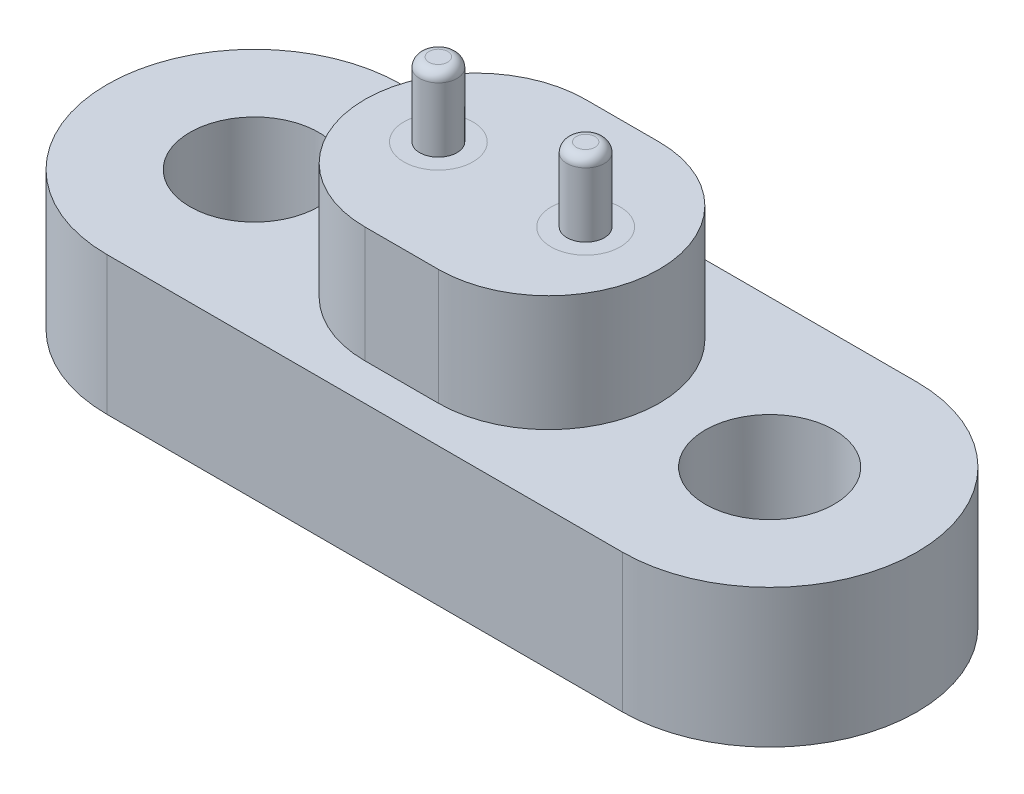
ISO-10303-21;
HEADER;
FILE_DESCRIPTION(('STEP AP214'),'2;1');
FILE_NAME('part.step','',(''),(''),'','','');
FILE_SCHEMA(('AUTOMOTIVE_DESIGN { 1 0 10303 214 1 1 1 1 }'));
ENDSEC;
DATA;
#1=APPLICATION_CONTEXT('core data for automotive mechanical design processes');
#2=APPLICATION_PROTOCOL_DEFINITION('international standard','automotive_design',2000,#1);
#3=PRODUCT_CONTEXT('',#1,'mechanical');
#4=PRODUCT('Part','Part','',(#3));
#5=PRODUCT_RELATED_PRODUCT_CATEGORY('part','',(#4));
#6=PRODUCT_DEFINITION_FORMATION('','',#4);
#7=PRODUCT_DEFINITION_CONTEXT('part definition',#1,'design');
#8=PRODUCT_DEFINITION('design','',#6,#7);
#9=PRODUCT_DEFINITION_SHAPE('','',#8);
#10=(LENGTH_UNIT() NAMED_UNIT(*) SI_UNIT(.MILLI.,.METRE.));
#11=(NAMED_UNIT(*) PLANE_ANGLE_UNIT() SI_UNIT($,.RADIAN.));
#12=(NAMED_UNIT(*) SI_UNIT($,.STERADIAN.) SOLID_ANGLE_UNIT());
#13=UNCERTAINTY_MEASURE_WITH_UNIT(LENGTH_MEASURE(1.E-05),#10,'distance_accuracy_value','');
#14=(GEOMETRIC_REPRESENTATION_CONTEXT(3) GLOBAL_UNCERTAINTY_ASSIGNED_CONTEXT((#13)) GLOBAL_UNIT_ASSIGNED_CONTEXT((#10,
#11,#12)) REPRESENTATION_CONTEXT('',''));
#15=CARTESIAN_POINT('',(0.,0.,0.));
#16=DIRECTION('',(0.,0.,1.));
#17=DIRECTION('',(1.,0.,0.));
#18=AXIS2_PLACEMENT_3D('',#15,#16,#17);
#19=CARTESIAN_POINT('',(2.00025,8.9088,0.));
#20=DIRECTION('',(0.,-1.,0.));
#21=DIRECTION('',(0.,0.,-1.));
#22=AXIS2_PLACEMENT_3D('',#19,#20,#21);
#23=CYLINDRICAL_SURFACE('',#22,0.508);
#24=CARTESIAN_POINT('',(2.00025,8.6548,0.));
#25=DIRECTION('',(0.,-1.,0.));
#26=DIRECTION('',(0.,0.,-1.));
#27=AXIS2_PLACEMENT_3D('',#24,#25,#26);
#28=CIRCLE('',#27,0.508);
#29=CARTESIAN_POINT('',(2.00025,8.6548,-0.508000000000001));
#30=VERTEX_POINT('',#29);
#31=EDGE_CURVE('E47',#30,#30,#28,.T.);
#32=ORIENTED_EDGE('',*,*,#31,.T.);
#33=EDGE_LOOP('',(#32));
#34=FACE_BOUND('',#33,.T.);
#35=CARTESIAN_POINT('',(2.00025,6.9088,0.));
#36=DIRECTION('',(0.,-1.,0.));
#37=DIRECTION('',(0.,0.,-1.));
#38=AXIS2_PLACEMENT_3D('',#35,#36,#37);
#39=CIRCLE('',#38,0.508);
#40=CARTESIAN_POINT('',(2.00025,6.9088,-0.508000000000001));
#41=VERTEX_POINT('',#40);
#42=EDGE_CURVE('E51',#41,#41,#39,.T.);
#43=ORIENTED_EDGE('',*,*,#42,.F.);
#44=EDGE_LOOP('',(#43));
#45=FACE_BOUND('',#44,.T.);
#46=ADVANCED_FACE('F40',(#34,#45),#23,.T.);
#47=CARTESIAN_POINT('',(2.00025,8.9088,0.));
#48=DIRECTION('',(0.,-1.,0.));
#49=DIRECTION('',(0.,0.,-1.));
#50=AXIS2_PLACEMENT_3D('',#47,#48,#49);
#51=PLANE('',#50);
#52=CARTESIAN_POINT('',(2.00025,8.9088,0.));
#53=DIRECTION('',(0.,-1.,0.));
#54=DIRECTION('',(0.,0.,-1.));
#55=AXIS2_PLACEMENT_3D('',#52,#53,#54);
#56=CIRCLE('',#55,0.254);
#57=CARTESIAN_POINT('',(2.00025,8.9088,-0.254000000000001));
#58=VERTEX_POINT('',#57);
#59=EDGE_CURVE('E11',#58,#58,#56,.F.);
#60=ORIENTED_EDGE('',*,*,#59,.T.);
#61=EDGE_LOOP('',(#60));
#62=FACE_BOUND('',#61,.T.);
#63=ADVANCED_FACE('F61',(#62),#51,.F.);
#64=CARTESIAN_POINT('',(2.00025,6.9088,0.));
#65=DIRECTION('',(0.,-1.,0.));
#66=DIRECTION('',(0.,0.,-1.));
#67=AXIS2_PLACEMENT_3D('',#64,#65,#66);
#68=PLANE('',#67);
#69=ORIENTED_EDGE('',*,*,#42,.T.);
#70=EDGE_LOOP('',(#69));
#71=FACE_BOUND('',#70,.T.);
#72=ADVANCED_FACE('F58',(#71),#68,.T.);
#73=CARTESIAN_POINT('',(2.00025,8.6548,0.));
#74=DIRECTION('',(0.,-1.,0.));
#75=DIRECTION('',(0.,0.,-1.));
#76=AXIS2_PLACEMENT_3D('',#73,#74,#75);
#77=TOROIDAL_SURFACE('',#76,0.254,0.254);
#78=ORIENTED_EDGE('',*,*,#59,.F.);
#79=EDGE_LOOP('',(#78));
#80=FACE_BOUND('',#79,.T.);
#81=ORIENTED_EDGE('',*,*,#31,.F.);
#82=EDGE_LOOP('',(#81));
#83=FACE_BOUND('',#82,.T.);
#84=ADVANCED_FACE('F42',(#80,#83),#77,.T.);
#85=CLOSED_SHELL('',(#46,#63,#72,#84));
#86=MANIFOLD_SOLID_BREP('B2',#85);
#87=CARTESIAN_POINT('',(-2.00025,8.9088,0.));
#88=DIRECTION('',(0.,-1.,0.));
#89=DIRECTION('',(0.,0.,-1.));
#90=AXIS2_PLACEMENT_3D('',#87,#88,#89);
#91=CYLINDRICAL_SURFACE('',#90,0.508);
#92=CARTESIAN_POINT('',(-2.00025,8.6548,0.));
#93=DIRECTION('',(0.,-1.,0.));
#94=DIRECTION('',(0.,0.,-1.));
#95=AXIS2_PLACEMENT_3D('',#92,#93,#94);
#96=CIRCLE('',#95,0.508);
#97=CARTESIAN_POINT('',(-2.00025,8.6548,-0.508));
#98=VERTEX_POINT('',#97);
#99=EDGE_CURVE('E111',#98,#98,#96,.T.);
#100=ORIENTED_EDGE('',*,*,#99,.T.);
#101=EDGE_LOOP('',(#100));
#102=FACE_BOUND('',#101,.T.);
#103=CARTESIAN_POINT('',(-2.00025,6.9088,0.));
#104=DIRECTION('',(0.,-1.,0.));
#105=DIRECTION('',(0.,0.,-1.));
#106=AXIS2_PLACEMENT_3D('',#103,#104,#105);
#107=CIRCLE('',#106,0.508);
#108=CARTESIAN_POINT('',(-2.00025,6.9088,-0.508));
#109=VERTEX_POINT('',#108);
#110=EDGE_CURVE('E115',#109,#109,#107,.T.);
#111=ORIENTED_EDGE('',*,*,#110,.F.);
#112=EDGE_LOOP('',(#111));
#113=FACE_BOUND('',#112,.T.);
#114=ADVANCED_FACE('F104',(#102,#113),#91,.T.);
#115=CARTESIAN_POINT('',(-2.00025,8.9088,0.));
#116=DIRECTION('',(0.,-1.,0.));
#117=DIRECTION('',(0.,0.,-1.));
#118=AXIS2_PLACEMENT_3D('',#115,#116,#117);
#119=PLANE('',#118);
#120=CARTESIAN_POINT('',(-2.00025,8.9088,0.));
#121=DIRECTION('',(0.,-1.,0.));
#122=DIRECTION('',(0.,0.,-1.));
#123=AXIS2_PLACEMENT_3D('',#120,#121,#122);
#124=CIRCLE('',#123,0.254);
#125=CARTESIAN_POINT('',(-2.00025,8.9088,-0.254));
#126=VERTEX_POINT('',#125);
#127=EDGE_CURVE('E39',#126,#126,#124,.F.);
#128=ORIENTED_EDGE('',*,*,#127,.T.);
#129=EDGE_LOOP('',(#128));
#130=FACE_BOUND('',#129,.T.);
#131=ADVANCED_FACE('F125',(#130),#119,.F.);
#132=CARTESIAN_POINT('',(-2.00025,6.9088,0.));
#133=DIRECTION('',(0.,-1.,0.));
#134=DIRECTION('',(0.,0.,-1.));
#135=AXIS2_PLACEMENT_3D('',#132,#133,#134);
#136=PLANE('',#135);
#137=ORIENTED_EDGE('',*,*,#110,.T.);
#138=EDGE_LOOP('',(#137));
#139=FACE_BOUND('',#138,.T.);
#140=ADVANCED_FACE('F122',(#139),#136,.T.);
#141=CARTESIAN_POINT('',(-2.00025,8.6548,0.));
#142=DIRECTION('',(0.,-1.,0.));
#143=DIRECTION('',(0.,0.,-1.));
#144=AXIS2_PLACEMENT_3D('',#141,#142,#143);
#145=DEGENERATE_TOROIDAL_SURFACE('',#144,0.254,0.254,.T.);
#146=ORIENTED_EDGE('',*,*,#127,.F.);
#147=EDGE_LOOP('',(#146));
#148=FACE_BOUND('',#147,.T.);
#149=ORIENTED_EDGE('',*,*,#99,.F.);
#150=EDGE_LOOP('',(#149));
#151=FACE_BOUND('',#150,.T.);
#152=ADVANCED_FACE('F106',(#148,#151),#145,.T.);
#153=CLOSED_SHELL('',(#114,#131,#140,#152));
#154=MANIFOLD_SOLID_BREP('B6',#153);
#155=CARTESIAN_POINT('',(2.00025,-0.0762000000000011,0.));
#156=DIRECTION('',(0.,1.,0.));
#157=DIRECTION('',(0.,0.,1.));
#158=AXIS2_PLACEMENT_3D('',#155,#156,#157);
#159=CYLINDRICAL_SURFACE('',#158,0.9398);
#160=CARTESIAN_POINT('',(2.00025,-0.0762000000000011,0.));
#161=DIRECTION('',(0.,1.,0.));
#162=DIRECTION('',(0.,0.,1.));
#163=AXIS2_PLACEMENT_3D('',#160,#161,#162);
#164=CIRCLE('',#163,0.9398);
#165=CARTESIAN_POINT('',(2.00025,-0.0762000000000011,0.939799999999999));
#166=VERTEX_POINT('',#165);
#167=EDGE_CURVE('E103',#166,#166,#164,.T.);
#168=ORIENTED_EDGE('',*,*,#167,.T.);
#169=EDGE_LOOP('',(#168));
#170=FACE_BOUND('',#169,.T.);
#171=CARTESIAN_POINT('',(2.00025,6.9088,0.));
#172=DIRECTION('',(0.,1.,0.));
#173=DIRECTION('',(0.,0.,1.));
#174=AXIS2_PLACEMENT_3D('',#171,#172,#173);
#175=CIRCLE('',#174,0.9398);
#176=CARTESIAN_POINT('',(2.00025,6.9088,0.939799999999999));
#177=VERTEX_POINT('',#176);
#178=EDGE_CURVE('E171',#177,#177,#175,.T.);
#179=ORIENTED_EDGE('',*,*,#178,.F.);
#180=EDGE_LOOP('',(#179));
#181=FACE_BOUND('',#180,.T.);
#182=ADVANCED_FACE('F168',(#170,#181),#159,.T.);
#183=CARTESIAN_POINT('',(2.00025,-0.0762000000000011,0.));
#184=DIRECTION('',(0.,1.,0.));
#185=DIRECTION('',(0.,0.,1.));
#186=AXIS2_PLACEMENT_3D('',#183,#184,#185);
#187=PLANE('',#186);
#188=ORIENTED_EDGE('',*,*,#167,.F.);
#189=EDGE_LOOP('',(#188));
#190=FACE_BOUND('',#189,.T.);
#191=ADVANCED_FACE('F183',(#190),#187,.F.);
#192=CARTESIAN_POINT('',(2.00025,6.9088,0.));
#193=DIRECTION('',(0.,1.,0.));
#194=DIRECTION('',(0.,0.,1.));
#195=AXIS2_PLACEMENT_3D('',#192,#193,#194);
#196=PLANE('',#195);
#197=ORIENTED_EDGE('',*,*,#178,.T.);
#198=EDGE_LOOP('',(#197));
#199=FACE_BOUND('',#198,.T.);
#200=ADVANCED_FACE('F180',(#199),#196,.T.);
#201=CLOSED_SHELL('',(#182,#191,#200));
#202=MANIFOLD_SOLID_BREP('B34',#201);
#203=CARTESIAN_POINT('',(-2.00025,-0.0762000000000011,0.));
#204=DIRECTION('',(0.,1.,0.));
#205=DIRECTION('',(0.,0.,1.));
#206=AXIS2_PLACEMENT_3D('',#203,#204,#205);
#207=CYLINDRICAL_SURFACE('',#206,0.9398);
#208=CARTESIAN_POINT('',(-2.00025,-0.0762000000000011,0.));
#209=DIRECTION('',(0.,1.,0.));
#210=DIRECTION('',(0.,0.,1.));
#211=AXIS2_PLACEMENT_3D('',#208,#209,#210);
#212=CIRCLE('',#211,0.9398);
#213=CARTESIAN_POINT('',(-2.00025,-0.0762000000000011,0.9398));
#214=VERTEX_POINT('',#213);
#215=EDGE_CURVE('E167',#214,#214,#212,.T.);
#216=ORIENTED_EDGE('',*,*,#215,.T.);
#217=EDGE_LOOP('',(#216));
#218=FACE_BOUND('',#217,.T.);
#219=CARTESIAN_POINT('',(-2.00025,6.9088,0.));
#220=DIRECTION('',(0.,1.,0.));
#221=DIRECTION('',(0.,0.,1.));
#222=AXIS2_PLACEMENT_3D('',#219,#220,#221);
#223=CIRCLE('',#222,0.9398);
#224=CARTESIAN_POINT('',(-2.00025,6.9088,0.9398));
#225=VERTEX_POINT('',#224);
#226=EDGE_CURVE('E221',#225,#225,#223,.T.);
#227=ORIENTED_EDGE('',*,*,#226,.F.);
#228=EDGE_LOOP('',(#227));
#229=FACE_BOUND('',#228,.T.);
#230=ADVANCED_FACE('F218',(#218,#229),#207,.T.);
#231=CARTESIAN_POINT('',(-2.00025,-0.0762000000000011,0.));
#232=DIRECTION('',(0.,1.,0.));
#233=DIRECTION('',(0.,0.,1.));
#234=AXIS2_PLACEMENT_3D('',#231,#232,#233);
#235=PLANE('',#234);
#236=ORIENTED_EDGE('',*,*,#215,.F.);
#237=EDGE_LOOP('',(#236));
#238=FACE_BOUND('',#237,.T.);
#239=ADVANCED_FACE('F233',(#238),#235,.F.);
#240=CARTESIAN_POINT('',(-2.00025,6.9088,0.));
#241=DIRECTION('',(0.,1.,0.));
#242=DIRECTION('',(0.,0.,1.));
#243=AXIS2_PLACEMENT_3D('',#240,#241,#242);
#244=PLANE('',#243);
#245=ORIENTED_EDGE('',*,*,#226,.T.);
#246=EDGE_LOOP('',(#245));
#247=FACE_BOUND('',#246,.T.);
#248=ADVANCED_FACE('F230',(#247),#244,.T.);
#249=CLOSED_SHELL('',(#230,#239,#248));
#250=MANIFOLD_SOLID_BREP('B98',#249);
#251=CARTESIAN_POINT('',(-6.99897,3.7592,0.));
#252=DIRECTION('',(0.,-1.,0.));
#253=DIRECTION('',(0.,0.,-1.));
#254=AXIS2_PLACEMENT_3D('',#251,#252,#253);
#255=CYLINDRICAL_SURFACE('',#254,4.0005);
#256=CARTESIAN_POINT('',(-6.99897,0.,0.));
#257=DIRECTION('',(0.,1.,0.));
#258=DIRECTION('',(0.,0.,1.));
#259=AXIS2_PLACEMENT_3D('',#256,#257,#258);
#260=CIRCLE('',#259,4.0005);
#261=CARTESIAN_POINT('',(-6.99897,0.,-4.0005));
#262=VERTEX_POINT('',#261);
#263=CARTESIAN_POINT('',(-6.99897,0.,4.0005));
#264=VERTEX_POINT('',#263);
#265=EDGE_CURVE('E346',#262,#264,#260,.T.);
#266=ORIENTED_EDGE('',*,*,#265,.T.);
#267=DIRECTION('',(0.,-1.,0.));
#268=VECTOR('',#267,1.);
#269=CARTESIAN_POINT('',(-6.99897,3.7592,4.0005));
#270=LINE('',#269,#268);
#271=CARTESIAN_POINT('',(-6.99897,3.7592,4.0005));
#272=VERTEX_POINT('',#271);
#273=EDGE_CURVE('E216',#272,#264,#270,.T.);
#274=ORIENTED_EDGE('',*,*,#273,.F.);
#275=CARTESIAN_POINT('',(-6.99897,3.7592,0.));
#276=DIRECTION('',(0.,1.,0.));
#277=DIRECTION('',(0.,0.,1.));
#278=AXIS2_PLACEMENT_3D('',#275,#276,#277);
#279=CIRCLE('',#278,4.0005);
#280=CARTESIAN_POINT('',(-6.99897,3.7592,-4.0005));
#281=VERTEX_POINT('',#280);
#282=EDGE_CURVE('E355',#281,#272,#279,.T.);
#283=ORIENTED_EDGE('',*,*,#282,.F.);
#284=DIRECTION('',(0.,-1.,0.));
#285=VECTOR('',#284,1.);
#286=CARTESIAN_POINT('',(-6.99897,3.7592,-4.0005));
#287=LINE('',#286,#285);
#288=EDGE_CURVE('E364',#281,#262,#287,.T.);
#289=ORIENTED_EDGE('',*,*,#288,.T.);
#290=EDGE_LOOP('',(#266,#274,#283,#289));
#291=FACE_BOUND('',#290,.T.);
#292=ADVANCED_FACE('F259',(#291),#255,.T.);
#293=CARTESIAN_POINT('',(-6.99897,3.7592,4.0005));
#294=DIRECTION('',(0.,0.,-1.));
#295=DIRECTION('',(-1.,0.,0.));
#296=AXIS2_PLACEMENT_3D('',#293,#294,#295);
#297=PLANE('',#296);
#298=DIRECTION('',(1.,0.,0.));
#299=VECTOR('',#298,1.);
#300=CARTESIAN_POINT('',(-6.99897,0.,4.0005));
#301=LINE('',#300,#299);
#302=CARTESIAN_POINT('',(6.99897,0.,4.0005));
#303=VERTEX_POINT('',#302);
#304=EDGE_CURVE('E349',#264,#303,#301,.T.);
#305=ORIENTED_EDGE('',*,*,#304,.T.);
#306=DIRECTION('',(0.,-1.,0.));
#307=VECTOR('',#306,1.);
#308=CARTESIAN_POINT('',(6.99897,3.7592,4.0005));
#309=LINE('',#308,#307);
#310=CARTESIAN_POINT('',(6.99897,3.7592,4.0005));
#311=VERTEX_POINT('',#310);
#312=EDGE_CURVE('E267',#311,#303,#309,.T.);
#313=ORIENTED_EDGE('',*,*,#312,.F.);
#314=DIRECTION('',(1.,0.,0.));
#315=VECTOR('',#314,1.);
#316=CARTESIAN_POINT('',(-6.99897,3.7592,4.0005));
#317=LINE('',#316,#315);
#318=EDGE_CURVE('E358',#272,#311,#317,.T.);
#319=ORIENTED_EDGE('',*,*,#318,.F.);
#320=ORIENTED_EDGE('',*,*,#273,.T.);
#321=EDGE_LOOP('',(#305,#313,#319,#320));
#322=FACE_BOUND('',#321,.T.);
#323=ADVANCED_FACE('F434',(#322),#297,.F.);
#324=CARTESIAN_POINT('',(6.99897,3.7592,0.));
#325=DIRECTION('',(0.,-1.,0.));
#326=DIRECTION('',(0.,0.,-1.));
#327=AXIS2_PLACEMENT_3D('',#324,#325,#326);
#328=CYLINDRICAL_SURFACE('',#327,4.0005);
#329=CARTESIAN_POINT('',(6.99897,0.,0.));
#330=DIRECTION('',(0.,1.,0.));
#331=DIRECTION('',(0.,0.,1.));
#332=AXIS2_PLACEMENT_3D('',#329,#330,#331);
#333=CIRCLE('',#332,4.0005);
#334=CARTESIAN_POINT('',(6.99897,0.,-4.00050000000001));
#335=VERTEX_POINT('',#334);
#336=EDGE_CURVE('E367',#303,#335,#333,.T.);
#337=ORIENTED_EDGE('',*,*,#336,.T.);
#338=DIRECTION('',(0.,-1.,0.));
#339=VECTOR('',#338,1.);
#340=CARTESIAN_POINT('',(6.99897,3.7592,-4.00050000000001));
#341=LINE('',#340,#339);
#342=CARTESIAN_POINT('',(6.99897,3.7592,-4.00050000000001));
#343=VERTEX_POINT('',#342);
#344=EDGE_CURVE('E372',#343,#335,#341,.T.);
#345=ORIENTED_EDGE('',*,*,#344,.F.);
#346=CARTESIAN_POINT('',(6.99897,3.7592,0.));
#347=DIRECTION('',(0.,1.,0.));
#348=DIRECTION('',(0.,0.,1.));
#349=AXIS2_PLACEMENT_3D('',#346,#347,#348);
#350=CIRCLE('',#349,4.0005);
#351=EDGE_CURVE('E361',#311,#343,#350,.T.);
#352=ORIENTED_EDGE('',*,*,#351,.F.);
#353=ORIENTED_EDGE('',*,*,#312,.T.);
#354=EDGE_LOOP('',(#337,#345,#352,#353));
#355=FACE_BOUND('',#354,.T.);
#356=ADVANCED_FACE('F439',(#355),#328,.T.);
#357=CARTESIAN_POINT('',(-6.99897,3.7592,-4.0005));
#358=DIRECTION('',(0.,0.,1.));
#359=DIRECTION('',(1.,0.,0.));
#360=AXIS2_PLACEMENT_3D('',#357,#358,#359);
#361=PLANE('',#360);
#362=DIRECTION('',(-1.,0.,0.));
#363=VECTOR('',#362,1.);
#364=CARTESIAN_POINT('',(-6.99897,0.,-4.0005));
#365=LINE('',#364,#363);
#366=EDGE_CURVE('E359',#335,#262,#365,.T.);
#367=ORIENTED_EDGE('',*,*,#366,.T.);
#368=ORIENTED_EDGE('',*,*,#288,.F.);
#369=DIRECTION('',(-1.,0.,0.));
#370=VECTOR('',#369,1.);
#371=CARTESIAN_POINT('',(-6.99897,3.7592,-4.0005));
#372=LINE('',#371,#370);
#373=EDGE_CURVE('E363',#343,#281,#372,.T.);
#374=ORIENTED_EDGE('',*,*,#373,.F.);
#375=ORIENTED_EDGE('',*,*,#344,.T.);
#376=EDGE_LOOP('',(#367,#368,#374,#375));
#377=FACE_BOUND('',#376,.T.);
#378=ADVANCED_FACE('F421',(#377),#361,.F.);
#379=CARTESIAN_POINT('',(-6.99897,3.7592,0.));
#380=DIRECTION('',(0.,1.,0.));
#381=DIRECTION('',(0.,0.,1.));
#382=AXIS2_PLACEMENT_3D('',#379,#380,#381);
#383=PLANE('',#382);
#384=CARTESIAN_POINT('',(-6.99897,3.7592,0.));
#385=DIRECTION('',(0.,1.,0.));
#386=DIRECTION('',(0.,0.,1.));
#387=AXIS2_PLACEMENT_3D('',#384,#385,#386);
#388=CIRCLE('',#387,1.75);
#389=CARTESIAN_POINT('',(-6.99897,3.7592,1.75));
#390=VERTEX_POINT('',#389);
#391=EDGE_CURVE('E378',#390,#390,#388,.T.);
#392=ORIENTED_EDGE('',*,*,#391,.F.);
#393=EDGE_LOOP('',(#392));
#394=FACE_BOUND('',#393,.T.);
#395=CARTESIAN_POINT('',(6.99897,3.7592,0.));
#396=DIRECTION('',(0.,1.,0.));
#397=DIRECTION('',(0.,0.,-1.));
#398=AXIS2_PLACEMENT_3D('',#395,#396,#397);
#399=CIRCLE('',#398,1.75);
#400=CARTESIAN_POINT('',(6.99897,3.7592,-1.75));
#401=VERTEX_POINT('',#400);
#402=EDGE_CURVE('E384',#401,#401,#399,.T.);
#403=ORIENTED_EDGE('',*,*,#402,.F.);
#404=EDGE_LOOP('',(#403));
#405=FACE_BOUND('',#404,.T.);
#406=CARTESIAN_POINT('',(-1.,3.7592,0.));
#407=DIRECTION('',(0.,1.,0.));
#408=DIRECTION('',(0.,0.,1.));
#409=AXIS2_PLACEMENT_3D('',#406,#407,#408);
#410=CIRCLE('',#409,2.9972);
#411=CARTESIAN_POINT('',(-1.,3.7592,-2.9972));
#412=VERTEX_POINT('',#411);
#413=CARTESIAN_POINT('',(-1.,3.7592,2.9972));
#414=VERTEX_POINT('',#413);
#415=EDGE_CURVE('E275',#412,#414,#410,.T.);
#416=ORIENTED_EDGE('',*,*,#415,.F.);
#417=DIRECTION('',(-1.,0.,0.));
#418=VECTOR('',#417,1.);
#419=CARTESIAN_POINT('',(-1.,3.7592,-2.9972));
#420=LINE('',#419,#418);
#421=CARTESIAN_POINT('',(0.999999999999999,3.7592,-2.9972));
#422=VERTEX_POINT('',#421);
#423=EDGE_CURVE('E279',#422,#412,#420,.T.);
#424=ORIENTED_EDGE('',*,*,#423,.F.);
#425=CARTESIAN_POINT('',(1.,3.7592,0.));
#426=DIRECTION('',(0.,1.,0.));
#427=DIRECTION('',(0.,0.,1.));
#428=AXIS2_PLACEMENT_3D('',#425,#426,#427);
#429=CIRCLE('',#428,2.9972);
#430=CARTESIAN_POINT('',(1.,3.7592,2.9972));
#431=VERTEX_POINT('',#430);
#432=EDGE_CURVE('E408',#431,#422,#429,.T.);
#433=ORIENTED_EDGE('',*,*,#432,.F.);
#434=DIRECTION('',(1.,0.,0.));
#435=VECTOR('',#434,1.);
#436=CARTESIAN_POINT('',(-1.,3.7592,2.9972));
#437=LINE('',#436,#435);
#438=EDGE_CURVE('E406',#414,#431,#437,.T.);
#439=ORIENTED_EDGE('',*,*,#438,.F.);
#440=EDGE_LOOP('',(#416,#424,#433,#439));
#441=FACE_BOUND('',#440,.T.);
#442=ORIENTED_EDGE('',*,*,#282,.T.);
#443=ORIENTED_EDGE('',*,*,#318,.T.);
#444=ORIENTED_EDGE('',*,*,#351,.T.);
#445=ORIENTED_EDGE('',*,*,#373,.T.);
#446=EDGE_LOOP('',(#442,#443,#444,#445));
#447=FACE_BOUND('',#446,.T.);
#448=ADVANCED_FACE('F417',(#394,#405,#441,#447),#383,.T.);
#449=CARTESIAN_POINT('',(-6.99897,0.,0.));
#450=DIRECTION('',(0.,1.,0.));
#451=DIRECTION('',(0.,0.,1.));
#452=AXIS2_PLACEMENT_3D('',#449,#450,#451);
#453=PLANE('',#452);
#454=CARTESIAN_POINT('',(-6.99897,0.,0.));
#455=DIRECTION('',(0.,1.,0.));
#456=DIRECTION('',(0.,0.,1.));
#457=AXIS2_PLACEMENT_3D('',#454,#455,#456);
#458=CIRCLE('',#457,1.75);
#459=CARTESIAN_POINT('',(-6.99897,0.,1.75));
#460=VERTEX_POINT('',#459);
#461=EDGE_CURVE('E262',#460,#460,#458,.T.);
#462=ORIENTED_EDGE('',*,*,#461,.T.);
#463=EDGE_LOOP('',(#462));
#464=FACE_BOUND('',#463,.T.);
#465=CARTESIAN_POINT('',(6.99897,0.,0.));
#466=DIRECTION('',(0.,1.,0.));
#467=DIRECTION('',(0.,0.,1.));
#468=AXIS2_PLACEMENT_3D('',#465,#466,#467);
#469=CIRCLE('',#468,1.75);
#470=CARTESIAN_POINT('',(6.99897,0.,1.75));
#471=VERTEX_POINT('',#470);
#472=EDGE_CURVE('E376',#471,#471,#469,.T.);
#473=ORIENTED_EDGE('',*,*,#472,.T.);
#474=EDGE_LOOP('',(#473));
#475=FACE_BOUND('',#474,.T.);
#476=ORIENTED_EDGE('',*,*,#265,.F.);
#477=ORIENTED_EDGE('',*,*,#366,.F.);
#478=ORIENTED_EDGE('',*,*,#336,.F.);
#479=ORIENTED_EDGE('',*,*,#304,.F.);
#480=EDGE_LOOP('',(#476,#477,#478,#479));
#481=FACE_BOUND('',#480,.T.);
#482=ADVANCED_FACE('F420',(#464,#475,#481),#453,.F.);
#483=CARTESIAN_POINT('',(-1.,6.9088,0.));
#484=DIRECTION('',(0.,1.,0.));
#485=DIRECTION('',(0.,0.,1.));
#486=AXIS2_PLACEMENT_3D('',#483,#484,#485);
#487=PLANE('',#486);
#488=CARTESIAN_POINT('',(-2.00025,6.9088,0.));
#489=DIRECTION('',(0.,1.,0.));
#490=DIRECTION('',(0.,0.,1.));
#491=AXIS2_PLACEMENT_3D('',#488,#489,#490);
#492=CIRCLE('',#491,0.9398);
#493=CARTESIAN_POINT('',(-2.00025,6.9088,0.9398));
#494=VERTEX_POINT('',#493);
#495=EDGE_CURVE('E397',#494,#494,#492,.T.);
#496=ORIENTED_EDGE('',*,*,#495,.F.);
#497=EDGE_LOOP('',(#496));
#498=FACE_BOUND('',#497,.T.);
#499=CARTESIAN_POINT('',(-1.,6.9088,0.));
#500=DIRECTION('',(0.,1.,0.));
#501=DIRECTION('',(0.,0.,1.));
#502=AXIS2_PLACEMENT_3D('',#499,#500,#501);
#503=CIRCLE('',#502,2.9972);
#504=CARTESIAN_POINT('',(-1.,6.9088,-2.9972));
#505=VERTEX_POINT('',#504);
#506=CARTESIAN_POINT('',(-1.,6.9088,2.9972));
#507=VERTEX_POINT('',#506);
#508=EDGE_CURVE('E334',#505,#507,#503,.T.);
#509=ORIENTED_EDGE('',*,*,#508,.T.);
#510=DIRECTION('',(1.,0.,0.));
#511=VECTOR('',#510,1.);
#512=CARTESIAN_POINT('',(-1.,6.9088,2.9972));
#513=LINE('',#512,#511);
#514=CARTESIAN_POINT('',(1.,6.9088,2.9972));
#515=VERTEX_POINT('',#514);
#516=EDGE_CURVE('E323',#507,#515,#513,.T.);
#517=ORIENTED_EDGE('',*,*,#516,.T.);
#518=CARTESIAN_POINT('',(1.,6.9088,0.));
#519=DIRECTION('',(0.,1.,0.));
#520=DIRECTION('',(0.,0.,1.));
#521=AXIS2_PLACEMENT_3D('',#518,#519,#520);
#522=CIRCLE('',#521,2.9972);
#523=CARTESIAN_POINT('',(0.999999999999999,6.9088,-2.9972));
#524=VERTEX_POINT('',#523);
#525=EDGE_CURVE('E333',#515,#524,#522,.T.);
#526=ORIENTED_EDGE('',*,*,#525,.T.);
#527=DIRECTION('',(-1.,0.,0.));
#528=VECTOR('',#527,1.);
#529=CARTESIAN_POINT('',(-1.,6.9088,-2.9972));
#530=LINE('',#529,#528);
#531=EDGE_CURVE('E340',#524,#505,#530,.T.);
#532=ORIENTED_EDGE('',*,*,#531,.T.);
#533=EDGE_LOOP('',(#509,#517,#526,#532));
#534=FACE_BOUND('',#533,.T.);
#535=CARTESIAN_POINT('',(2.00025,6.9088,0.));
#536=DIRECTION('',(0.,1.,0.));
#537=DIRECTION('',(0.,0.,1.));
#538=AXIS2_PLACEMENT_3D('',#535,#536,#537);
#539=CIRCLE('',#538,0.9398);
#540=CARTESIAN_POINT('',(2.00025,6.9088,0.939799999999999));
#541=VERTEX_POINT('',#540);
#542=EDGE_CURVE('E391',#541,#541,#539,.T.);
#543=ORIENTED_EDGE('',*,*,#542,.F.);
#544=EDGE_LOOP('',(#543));
#545=FACE_BOUND('',#544,.T.);
#546=ADVANCED_FACE('F337',(#498,#534,#545),#487,.T.);
#547=CARTESIAN_POINT('',(-1.,6.9088,0.));
#548=DIRECTION('',(0.,-1.,0.));
#549=DIRECTION('',(0.,0.,-1.));
#550=AXIS2_PLACEMENT_3D('',#547,#548,#549);
#551=CYLINDRICAL_SURFACE('',#550,2.9972);
#552=ORIENTED_EDGE('',*,*,#415,.T.);
#553=DIRECTION('',(0.,-1.,0.));
#554=VECTOR('',#553,1.);
#555=CARTESIAN_POINT('',(-1.,6.9088,2.9972));
#556=LINE('',#555,#554);
#557=EDGE_CURVE('E328',#507,#414,#556,.T.);
#558=ORIENTED_EDGE('',*,*,#557,.F.);
#559=ORIENTED_EDGE('',*,*,#508,.F.);
#560=DIRECTION('',(0.,-1.,0.));
#561=VECTOR('',#560,1.);
#562=CARTESIAN_POINT('',(-1.,6.9088,-2.9972));
#563=LINE('',#562,#561);
#564=EDGE_CURVE('E404',#505,#412,#563,.T.);
#565=ORIENTED_EDGE('',*,*,#564,.T.);
#566=EDGE_LOOP('',(#552,#558,#559,#565));
#567=FACE_BOUND('',#566,.T.);
#568=ADVANCED_FACE('F345',(#567),#551,.T.);
#569=CARTESIAN_POINT('',(-1.,6.9088,2.9972));
#570=DIRECTION('',(0.,0.,-1.));
#571=DIRECTION('',(-1.,0.,0.));
#572=AXIS2_PLACEMENT_3D('',#569,#570,#571);
#573=PLANE('',#572);
#574=ORIENTED_EDGE('',*,*,#438,.T.);
#575=DIRECTION('',(0.,-1.,0.));
#576=VECTOR('',#575,1.);
#577=CARTESIAN_POINT('',(1.,6.9088,2.9972));
#578=LINE('',#577,#576);
#579=EDGE_CURVE('E330',#515,#431,#578,.T.);
#580=ORIENTED_EDGE('',*,*,#579,.F.);
#581=ORIENTED_EDGE('',*,*,#516,.F.);
#582=ORIENTED_EDGE('',*,*,#557,.T.);
#583=EDGE_LOOP('',(#574,#580,#581,#582));
#584=FACE_BOUND('',#583,.T.);
#585=ADVANCED_FACE('F326',(#584),#573,.F.);
#586=CARTESIAN_POINT('',(1.,6.9088,0.));
#587=DIRECTION('',(0.,-1.,0.));
#588=DIRECTION('',(0.,0.,-1.));
#589=AXIS2_PLACEMENT_3D('',#586,#587,#588);
#590=CYLINDRICAL_SURFACE('',#589,2.9972);
#591=ORIENTED_EDGE('',*,*,#432,.T.);
#592=DIRECTION('',(0.,-1.,0.));
#593=VECTOR('',#592,1.);
#594=CARTESIAN_POINT('',(0.999999999999999,6.9088,-2.9972));
#595=LINE('',#594,#593);
#596=EDGE_CURVE('E351',#524,#422,#595,.T.);
#597=ORIENTED_EDGE('',*,*,#596,.F.);
#598=ORIENTED_EDGE('',*,*,#525,.F.);
#599=ORIENTED_EDGE('',*,*,#579,.T.);
#600=EDGE_LOOP('',(#591,#597,#598,#599));
#601=FACE_BOUND('',#600,.T.);
#602=ADVANCED_FACE('F416',(#601),#590,.T.);
#603=CARTESIAN_POINT('',(-1.,6.9088,-2.9972));
#604=DIRECTION('',(0.,0.,1.));
#605=DIRECTION('',(1.,0.,0.));
#606=AXIS2_PLACEMENT_3D('',#603,#604,#605);
#607=PLANE('',#606);
#608=ORIENTED_EDGE('',*,*,#423,.T.);
#609=ORIENTED_EDGE('',*,*,#564,.F.);
#610=ORIENTED_EDGE('',*,*,#531,.F.);
#611=ORIENTED_EDGE('',*,*,#596,.T.);
#612=EDGE_LOOP('',(#608,#609,#610,#611));
#613=FACE_BOUND('',#612,.T.);
#614=ADVANCED_FACE('F414',(#613),#607,.F.);
#615=CARTESIAN_POINT('',(-2.00025,6.9088,0.));
#616=DIRECTION('',(0.,-1.,0.));
#617=DIRECTION('',(0.,0.,-1.));
#618=AXIS2_PLACEMENT_3D('',#615,#616,#617);
#619=CYLINDRICAL_SURFACE('',#618,0.9398);
#620=ORIENTED_EDGE('',*,*,#495,.T.);
#621=EDGE_LOOP('',(#620));
#622=FACE_BOUND('',#621,.T.);
#623=CARTESIAN_POINT('',(-2.00025,3.7592,0.));
#624=DIRECTION('',(0.,1.,0.));
#625=DIRECTION('',(0.,0.,1.));
#626=AXIS2_PLACEMENT_3D('',#623,#624,#625);
#627=CIRCLE('',#626,0.9398);
#628=CARTESIAN_POINT('',(-2.00025,3.7592,0.9398));
#629=VERTEX_POINT('',#628);
#630=EDGE_CURVE('E394',#629,#629,#627,.T.);
#631=ORIENTED_EDGE('',*,*,#630,.F.);
#632=EDGE_LOOP('',(#631));
#633=FACE_BOUND('',#632,.T.);
#634=ADVANCED_FACE('F508',(#622,#633),#619,.F.);
#635=CARTESIAN_POINT('',(2.00025,6.9088,0.));
#636=DIRECTION('',(0.,-1.,0.));
#637=DIRECTION('',(0.,0.,-1.));
#638=AXIS2_PLACEMENT_3D('',#635,#636,#637);
#639=CYLINDRICAL_SURFACE('',#638,0.9398);
#640=ORIENTED_EDGE('',*,*,#542,.T.);
#641=EDGE_LOOP('',(#640));
#642=FACE_BOUND('',#641,.T.);
#643=CARTESIAN_POINT('',(2.00025,3.7592,0.));
#644=DIRECTION('',(0.,1.,0.));
#645=DIRECTION('',(0.,0.,1.));
#646=AXIS2_PLACEMENT_3D('',#643,#644,#645);
#647=CIRCLE('',#646,0.9398);
#648=CARTESIAN_POINT('',(2.00025,3.7592,0.939799999999999));
#649=VERTEX_POINT('',#648);
#650=EDGE_CURVE('E382',#649,#649,#647,.T.);
#651=ORIENTED_EDGE('',*,*,#650,.F.);
#652=EDGE_LOOP('',(#651));
#653=FACE_BOUND('',#652,.T.);
#654=ADVANCED_FACE('F505',(#642,#653),#639,.F.);
#655=ORIENTED_EDGE('',*,*,#630,.T.);
#656=EDGE_LOOP('',(#655));
#657=FACE_BOUND('',#656,.T.);
#658=ADVANCED_FACE('F424',(#657),#383,.T.);
#659=ORIENTED_EDGE('',*,*,#650,.T.);
#660=EDGE_LOOP('',(#659));
#661=FACE_BOUND('',#660,.T.);
#662=ADVANCED_FACE('F425',(#661),#383,.T.);
#663=CARTESIAN_POINT('',(6.99897,-0.0762000000000011,0.));
#664=DIRECTION('',(0.,1.,0.));
#665=DIRECTION('',(0.,0.,1.));
#666=AXIS2_PLACEMENT_3D('',#663,#664,#665);
#667=CYLINDRICAL_SURFACE('',#666,1.75);
#668=ORIENTED_EDGE('',*,*,#402,.T.);
#669=EDGE_LOOP('',(#668));
#670=FACE_BOUND('',#669,.T.);
#671=ORIENTED_EDGE('',*,*,#472,.F.);
#672=EDGE_LOOP('',(#671));
#673=FACE_BOUND('',#672,.T.);
#674=ADVANCED_FACE('F484',(#670,#673),#667,.F.);
#675=CARTESIAN_POINT('',(-6.99897,-0.0762000000000011,0.));
#676=DIRECTION('',(0.,1.,0.));
#677=DIRECTION('',(0.,0.,1.));
#678=AXIS2_PLACEMENT_3D('',#675,#676,#677);
#679=CYLINDRICAL_SURFACE('',#678,1.75);
#680=ORIENTED_EDGE('',*,*,#391,.T.);
#681=EDGE_LOOP('',(#680));
#682=FACE_BOUND('',#681,.T.);
#683=ORIENTED_EDGE('',*,*,#461,.F.);
#684=EDGE_LOOP('',(#683));
#685=FACE_BOUND('',#684,.T.);
#686=ADVANCED_FACE('F489',(#682,#685),#679,.F.);
#687=CLOSED_SHELL('',(#292,#323,#356,#378,#448,#482,#546,#568,#585,#602,#614,#634,#654,#658,
#662,#674,#686));
#688=MANIFOLD_SOLID_BREP('B162',#687);
#689=ADVANCED_BREP_SHAPE_REPRESENTATION('',(#18,#86,#154,#202,#250,#688),#14);
#690=SHAPE_DEFINITION_REPRESENTATION(#9,#689);
ENDSEC;
END-ISO-10303-21;
